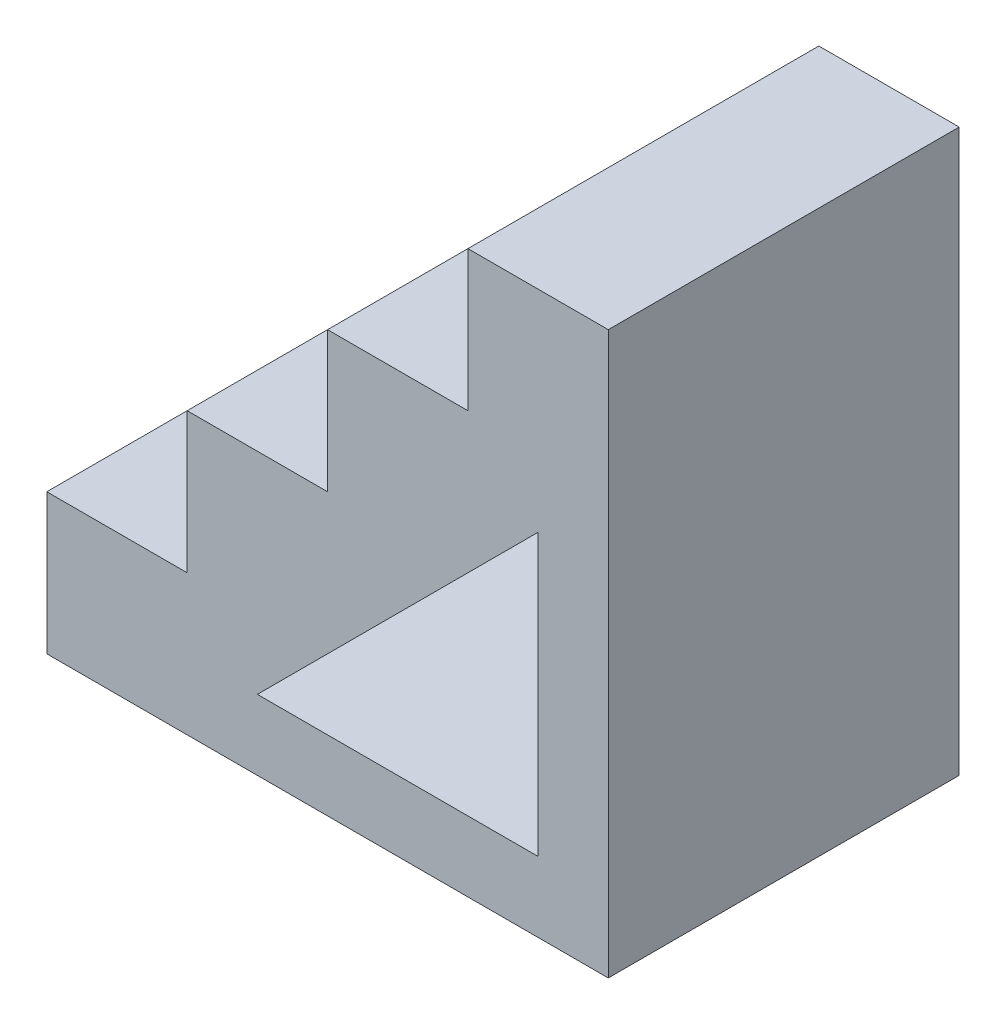
ISO-10303-21;
HEADER;
FILE_DESCRIPTION(('STEP AP214'),'2;1');
FILE_NAME('part.step','',(''),(''),'','','');
FILE_SCHEMA(('AUTOMOTIVE_DESIGN { 1 0 10303 214 1 1 1 1 }'));
ENDSEC;
DATA;
#1=APPLICATION_CONTEXT('core data for automotive mechanical design processes');
#2=APPLICATION_PROTOCOL_DEFINITION('international standard','automotive_design',2000,#1);
#3=PRODUCT_CONTEXT('',#1,'mechanical');
#4=PRODUCT('Part','Part','',(#3));
#5=PRODUCT_RELATED_PRODUCT_CATEGORY('part','',(#4));
#6=PRODUCT_DEFINITION_FORMATION('','',#4);
#7=PRODUCT_DEFINITION_CONTEXT('part definition',#1,'design');
#8=PRODUCT_DEFINITION('design','',#6,#7);
#9=PRODUCT_DEFINITION_SHAPE('','',#8);
#10=(LENGTH_UNIT() NAMED_UNIT(*) SI_UNIT(.MILLI.,.METRE.));
#11=(NAMED_UNIT(*) PLANE_ANGLE_UNIT() SI_UNIT($,.RADIAN.));
#12=(NAMED_UNIT(*) SI_UNIT($,.STERADIAN.) SOLID_ANGLE_UNIT());
#13=UNCERTAINTY_MEASURE_WITH_UNIT(LENGTH_MEASURE(1.E-05),#10,'distance_accuracy_value','');
#14=(GEOMETRIC_REPRESENTATION_CONTEXT(3) GLOBAL_UNCERTAINTY_ASSIGNED_CONTEXT((#13)) GLOBAL_UNIT_ASSIGNED_CONTEXT((#10,
#11,#12)) REPRESENTATION_CONTEXT('',''));
#15=CARTESIAN_POINT('',(0.,0.,0.));
#16=DIRECTION('',(0.,0.,1.));
#17=DIRECTION('',(1.,0.,0.));
#18=AXIS2_PLACEMENT_3D('',#15,#16,#17);
#19=CARTESIAN_POINT('',(20.,20.,50.));
#20=DIRECTION('',(-1.,0.,0.));
#21=DIRECTION('',(0.,-1.,0.));
#22=AXIS2_PLACEMENT_3D('',#19,#20,#21);
#23=PLANE('',#22);
#24=DIRECTION('',(0.,1.,0.));
#25=VECTOR('',#24,1.);
#26=CARTESIAN_POINT('',(20.,20.,0.));
#27=LINE('',#26,#25);
#28=CARTESIAN_POINT('',(20.,20.,0.));
#29=VERTEX_POINT('',#28);
#30=CARTESIAN_POINT('',(20.,40.,0.));
#31=VERTEX_POINT('',#30);
#32=EDGE_CURVE('E157',#29,#31,#27,.T.);
#33=ORIENTED_EDGE('',*,*,#32,.F.);
#34=DIRECTION('',(0.,0.,-1.));
#35=VECTOR('',#34,1.);
#36=CARTESIAN_POINT('',(20.,20.,50.));
#37=LINE('',#36,#35);
#38=CARTESIAN_POINT('',(20.,20.,50.));
#39=VERTEX_POINT('',#38);
#40=EDGE_CURVE('E11',#39,#29,#37,.T.);
#41=ORIENTED_EDGE('',*,*,#40,.F.);
#42=DIRECTION('',(0.,1.,0.));
#43=VECTOR('',#42,1.);
#44=CARTESIAN_POINT('',(20.,20.,50.));
#45=LINE('',#44,#43);
#46=CARTESIAN_POINT('',(20.,40.,50.));
#47=VERTEX_POINT('',#46);
#48=EDGE_CURVE('E159',#39,#47,#45,.T.);
#49=ORIENTED_EDGE('',*,*,#48,.T.);
#50=DIRECTION('',(0.,0.,-1.));
#51=VECTOR('',#50,1.);
#52=CARTESIAN_POINT('',(20.,40.,50.));
#53=LINE('',#52,#51);
#54=EDGE_CURVE('E39',#47,#31,#53,.T.);
#55=ORIENTED_EDGE('',*,*,#54,.T.);
#56=EDGE_LOOP('',(#33,#41,#49,#55));
#57=FACE_BOUND('',#56,.T.);
#58=ADVANCED_FACE('F36',(#57),#23,.T.);
#59=CARTESIAN_POINT('',(0.,20.,50.));
#60=DIRECTION('',(0.,1.,0.));
#61=DIRECTION('',(-1.,0.,0.));
#62=AXIS2_PLACEMENT_3D('',#59,#60,#61);
#63=PLANE('',#62);
#64=DIRECTION('',(1.,0.,0.));
#65=VECTOR('',#64,1.);
#66=CARTESIAN_POINT('',(0.,20.,0.));
#67=LINE('',#66,#65);
#68=CARTESIAN_POINT('',(0.,20.,0.));
#69=VERTEX_POINT('',#68);
#70=EDGE_CURVE('E163',#69,#29,#67,.T.);
#71=ORIENTED_EDGE('',*,*,#70,.F.);
#72=DIRECTION('',(0.,0.,-1.));
#73=VECTOR('',#72,1.);
#74=CARTESIAN_POINT('',(0.,20.,50.));
#75=LINE('',#74,#73);
#76=CARTESIAN_POINT('',(0.,20.,50.));
#77=VERTEX_POINT('',#76);
#78=EDGE_CURVE('E44',#77,#69,#75,.T.);
#79=ORIENTED_EDGE('',*,*,#78,.F.);
#80=DIRECTION('',(1.,0.,0.));
#81=VECTOR('',#80,1.);
#82=CARTESIAN_POINT('',(0.,20.,50.));
#83=LINE('',#82,#81);
#84=EDGE_CURVE('E187',#77,#39,#83,.T.);
#85=ORIENTED_EDGE('',*,*,#84,.T.);
#86=ORIENTED_EDGE('',*,*,#40,.T.);
#87=EDGE_LOOP('',(#71,#79,#85,#86));
#88=FACE_BOUND('',#87,.T.);
#89=ADVANCED_FACE('F242',(#88),#63,.T.);
#90=CARTESIAN_POINT('',(0.,0.,50.));
#91=DIRECTION('',(-1.,0.,0.));
#92=DIRECTION('',(0.,0.,1.));
#93=AXIS2_PLACEMENT_3D('',#90,#91,#92);
#94=PLANE('',#93);
#95=DIRECTION('',(0.,1.,0.));
#96=VECTOR('',#95,1.);
#97=CARTESIAN_POINT('',(0.,0.,0.));
#98=LINE('',#97,#96);
#99=CARTESIAN_POINT('',(0.,0.,0.));
#100=VERTEX_POINT('',#99);
#101=EDGE_CURVE('E213',#100,#69,#98,.T.);
#102=ORIENTED_EDGE('',*,*,#101,.F.);
#103=DIRECTION('',(0.,0.,-1.));
#104=VECTOR('',#103,1.);
#105=CARTESIAN_POINT('',(0.,0.,50.));
#106=LINE('',#105,#104);
#107=CARTESIAN_POINT('',(0.,0.,50.));
#108=VERTEX_POINT('',#107);
#109=EDGE_CURVE('E219',#108,#100,#106,.T.);
#110=ORIENTED_EDGE('',*,*,#109,.F.);
#111=DIRECTION('',(0.,1.,0.));
#112=VECTOR('',#111,1.);
#113=CARTESIAN_POINT('',(0.,0.,50.));
#114=LINE('',#113,#112);
#115=EDGE_CURVE('E184',#108,#77,#114,.T.);
#116=ORIENTED_EDGE('',*,*,#115,.T.);
#117=ORIENTED_EDGE('',*,*,#78,.T.);
#118=EDGE_LOOP('',(#102,#110,#116,#117));
#119=FACE_BOUND('',#118,.T.);
#120=ADVANCED_FACE('F271',(#119),#94,.T.);
#121=CARTESIAN_POINT('',(80.,0.,50.));
#122=DIRECTION('',(0.,-1.,0.));
#123=DIRECTION('',(1.,0.,0.));
#124=AXIS2_PLACEMENT_3D('',#121,#122,#123);
#125=PLANE('',#124);
#126=DIRECTION('',(-1.,0.,0.));
#127=VECTOR('',#126,1.);
#128=CARTESIAN_POINT('',(80.,0.,0.));
#129=LINE('',#128,#127);
#130=CARTESIAN_POINT('',(80.,0.,0.));
#131=VERTEX_POINT('',#130);
#132=EDGE_CURVE('E210',#131,#100,#129,.T.);
#133=ORIENTED_EDGE('',*,*,#132,.F.);
#134=DIRECTION('',(0.,0.,-1.));
#135=VECTOR('',#134,1.);
#136=CARTESIAN_POINT('',(80.,0.,50.));
#137=LINE('',#136,#135);
#138=CARTESIAN_POINT('',(80.,0.,50.));
#139=VERTEX_POINT('',#138);
#140=EDGE_CURVE('E221',#139,#131,#137,.T.);
#141=ORIENTED_EDGE('',*,*,#140,.F.);
#142=DIRECTION('',(-1.,0.,0.));
#143=VECTOR('',#142,1.);
#144=CARTESIAN_POINT('',(80.,0.,50.));
#145=LINE('',#144,#143);
#146=EDGE_CURVE('E181',#139,#108,#145,.T.);
#147=ORIENTED_EDGE('',*,*,#146,.T.);
#148=ORIENTED_EDGE('',*,*,#109,.T.);
#149=EDGE_LOOP('',(#133,#141,#147,#148));
#150=FACE_BOUND('',#149,.T.);
#151=ADVANCED_FACE('F269',(#150),#125,.T.);
#152=CARTESIAN_POINT('',(80.,80.,50.));
#153=DIRECTION('',(1.,0.,0.));
#154=DIRECTION('',(0.,1.,0.));
#155=AXIS2_PLACEMENT_3D('',#152,#153,#154);
#156=PLANE('',#155);
#157=DIRECTION('',(0.,-1.,0.));
#158=VECTOR('',#157,1.);
#159=CARTESIAN_POINT('',(80.,80.,0.));
#160=LINE('',#159,#158);
#161=CARTESIAN_POINT('',(80.,80.,0.));
#162=VERTEX_POINT('',#161);
#163=EDGE_CURVE('E207',#162,#131,#160,.T.);
#164=ORIENTED_EDGE('',*,*,#163,.F.);
#165=DIRECTION('',(0.,0.,-1.));
#166=VECTOR('',#165,1.);
#167=CARTESIAN_POINT('',(80.,80.,50.));
#168=LINE('',#167,#166);
#169=CARTESIAN_POINT('',(80.,80.,50.));
#170=VERTEX_POINT('',#169);
#171=EDGE_CURVE('E223',#170,#162,#168,.T.);
#172=ORIENTED_EDGE('',*,*,#171,.F.);
#173=DIRECTION('',(0.,-1.,0.));
#174=VECTOR('',#173,1.);
#175=CARTESIAN_POINT('',(80.,80.,50.));
#176=LINE('',#175,#174);
#177=EDGE_CURVE('E178',#170,#139,#176,.T.);
#178=ORIENTED_EDGE('',*,*,#177,.T.);
#179=ORIENTED_EDGE('',*,*,#140,.T.);
#180=EDGE_LOOP('',(#164,#172,#178,#179));
#181=FACE_BOUND('',#180,.T.);
#182=ADVANCED_FACE('F265',(#181),#156,.T.);
#183=CARTESIAN_POINT('',(60.,80.,50.));
#184=DIRECTION('',(0.,1.,0.));
#185=DIRECTION('',(0.,0.,1.));
#186=AXIS2_PLACEMENT_3D('',#183,#184,#185);
#187=PLANE('',#186);
#188=DIRECTION('',(1.,0.,0.));
#189=VECTOR('',#188,1.);
#190=CARTESIAN_POINT('',(60.,80.,0.));
#191=LINE('',#190,#189);
#192=CARTESIAN_POINT('',(60.,80.,0.));
#193=VERTEX_POINT('',#192);
#194=EDGE_CURVE('E204',#193,#162,#191,.T.);
#195=ORIENTED_EDGE('',*,*,#194,.F.);
#196=DIRECTION('',(0.,0.,-1.));
#197=VECTOR('',#196,1.);
#198=CARTESIAN_POINT('',(60.,80.,50.));
#199=LINE('',#198,#197);
#200=CARTESIAN_POINT('',(60.,80.,50.));
#201=VERTEX_POINT('',#200);
#202=EDGE_CURVE('E225',#201,#193,#199,.T.);
#203=ORIENTED_EDGE('',*,*,#202,.F.);
#204=DIRECTION('',(1.,0.,0.));
#205=VECTOR('',#204,1.);
#206=CARTESIAN_POINT('',(60.,80.,50.));
#207=LINE('',#206,#205);
#208=EDGE_CURVE('E175',#201,#170,#207,.T.);
#209=ORIENTED_EDGE('',*,*,#208,.T.);
#210=ORIENTED_EDGE('',*,*,#171,.T.);
#211=EDGE_LOOP('',(#195,#203,#209,#210));
#212=FACE_BOUND('',#211,.T.);
#213=ADVANCED_FACE('F261',(#212),#187,.T.);
#214=CARTESIAN_POINT('',(60.,60.,50.));
#215=DIRECTION('',(-1.,0.,0.));
#216=DIRECTION('',(0.,0.,1.));
#217=AXIS2_PLACEMENT_3D('',#214,#215,#216);
#218=PLANE('',#217);
#219=DIRECTION('',(0.,1.,0.));
#220=VECTOR('',#219,1.);
#221=CARTESIAN_POINT('',(60.,60.,0.));
#222=LINE('',#221,#220);
#223=CARTESIAN_POINT('',(60.,60.,0.));
#224=VERTEX_POINT('',#223);
#225=EDGE_CURVE('E201',#224,#193,#222,.T.);
#226=ORIENTED_EDGE('',*,*,#225,.F.);
#227=DIRECTION('',(0.,0.,-1.));
#228=VECTOR('',#227,1.);
#229=CARTESIAN_POINT('',(60.,60.,50.));
#230=LINE('',#229,#228);
#231=CARTESIAN_POINT('',(60.,60.,50.));
#232=VERTEX_POINT('',#231);
#233=EDGE_CURVE('E227',#232,#224,#230,.T.);
#234=ORIENTED_EDGE('',*,*,#233,.F.);
#235=DIRECTION('',(0.,1.,0.));
#236=VECTOR('',#235,1.);
#237=CARTESIAN_POINT('',(60.,60.,50.));
#238=LINE('',#237,#236);
#239=EDGE_CURVE('E172',#232,#201,#238,.T.);
#240=ORIENTED_EDGE('',*,*,#239,.T.);
#241=ORIENTED_EDGE('',*,*,#202,.T.);
#242=EDGE_LOOP('',(#226,#234,#240,#241));
#243=FACE_BOUND('',#242,.T.);
#244=ADVANCED_FACE('F257',(#243),#218,.T.);
#245=CARTESIAN_POINT('',(40.,60.,50.));
#246=DIRECTION('',(0.,1.,0.));
#247=DIRECTION('',(-1.,0.,0.));
#248=AXIS2_PLACEMENT_3D('',#245,#246,#247);
#249=PLANE('',#248);
#250=DIRECTION('',(1.,0.,0.));
#251=VECTOR('',#250,1.);
#252=CARTESIAN_POINT('',(40.,60.,0.));
#253=LINE('',#252,#251);
#254=CARTESIAN_POINT('',(40.,60.,0.));
#255=VERTEX_POINT('',#254);
#256=EDGE_CURVE('E198',#255,#224,#253,.T.);
#257=ORIENTED_EDGE('',*,*,#256,.F.);
#258=DIRECTION('',(0.,0.,-1.));
#259=VECTOR('',#258,1.);
#260=CARTESIAN_POINT('',(40.,60.,50.));
#261=LINE('',#260,#259);
#262=CARTESIAN_POINT('',(40.,60.,50.));
#263=VERTEX_POINT('',#262);
#264=EDGE_CURVE('E229',#263,#255,#261,.T.);
#265=ORIENTED_EDGE('',*,*,#264,.F.);
#266=DIRECTION('',(1.,0.,0.));
#267=VECTOR('',#266,1.);
#268=CARTESIAN_POINT('',(40.,60.,50.));
#269=LINE('',#268,#267);
#270=EDGE_CURVE('E169',#263,#232,#269,.T.);
#271=ORIENTED_EDGE('',*,*,#270,.T.);
#272=ORIENTED_EDGE('',*,*,#233,.T.);
#273=EDGE_LOOP('',(#257,#265,#271,#272));
#274=FACE_BOUND('',#273,.T.);
#275=ADVANCED_FACE('F255',(#274),#249,.T.);
#276=CARTESIAN_POINT('',(40.,40.,50.));
#277=DIRECTION('',(-1.,0.,0.));
#278=DIRECTION('',(0.,-1.,0.));
#279=AXIS2_PLACEMENT_3D('',#276,#277,#278);
#280=PLANE('',#279);
#281=DIRECTION('',(0.,1.,0.));
#282=VECTOR('',#281,1.);
#283=CARTESIAN_POINT('',(40.,40.,0.));
#284=LINE('',#283,#282);
#285=CARTESIAN_POINT('',(40.,40.,0.));
#286=VERTEX_POINT('',#285);
#287=EDGE_CURVE('E195',#286,#255,#284,.T.);
#288=ORIENTED_EDGE('',*,*,#287,.F.);
#289=DIRECTION('',(0.,0.,-1.));
#290=VECTOR('',#289,1.);
#291=CARTESIAN_POINT('',(40.,40.,50.));
#292=LINE('',#291,#290);
#293=CARTESIAN_POINT('',(40.,40.,50.));
#294=VERTEX_POINT('',#293);
#295=EDGE_CURVE('E230',#294,#286,#292,.T.);
#296=ORIENTED_EDGE('',*,*,#295,.F.);
#297=DIRECTION('',(0.,1.,0.));
#298=VECTOR('',#297,1.);
#299=CARTESIAN_POINT('',(40.,40.,50.));
#300=LINE('',#299,#298);
#301=EDGE_CURVE('E166',#294,#263,#300,.T.);
#302=ORIENTED_EDGE('',*,*,#301,.T.);
#303=ORIENTED_EDGE('',*,*,#264,.T.);
#304=EDGE_LOOP('',(#288,#296,#302,#303));
#305=FACE_BOUND('',#304,.T.);
#306=ADVANCED_FACE('F251',(#305),#280,.T.);
#307=CARTESIAN_POINT('',(20.,40.,50.));
#308=DIRECTION('',(0.,1.,0.));
#309=DIRECTION('',(-1.,0.,0.));
#310=AXIS2_PLACEMENT_3D('',#307,#308,#309);
#311=PLANE('',#310);
#312=DIRECTION('',(1.,0.,0.));
#313=VECTOR('',#312,1.);
#314=CARTESIAN_POINT('',(20.,40.,0.));
#315=LINE('',#314,#313);
#316=EDGE_CURVE('E192',#31,#286,#315,.T.);
#317=ORIENTED_EDGE('',*,*,#316,.F.);
#318=ORIENTED_EDGE('',*,*,#54,.F.);
#319=DIRECTION('',(1.,0.,0.));
#320=VECTOR('',#319,1.);
#321=CARTESIAN_POINT('',(20.,40.,50.));
#322=LINE('',#321,#320);
#323=EDGE_CURVE('E162',#47,#294,#322,.T.);
#324=ORIENTED_EDGE('',*,*,#323,.T.);
#325=ORIENTED_EDGE('',*,*,#295,.T.);
#326=EDGE_LOOP('',(#317,#318,#324,#325));
#327=FACE_BOUND('',#326,.T.);
#328=ADVANCED_FACE('F238',(#327),#311,.T.);
#329=CARTESIAN_POINT('',(0.,0.,50.));
#330=DIRECTION('',(0.,0.,-1.));
#331=DIRECTION('',(-1.,0.,0.));
#332=AXIS2_PLACEMENT_3D('',#329,#330,#331);
#333=PLANE('',#332);
#334=DIRECTION('',(1.,0.,0.));
#335=VECTOR('',#334,1.);
#336=CARTESIAN_POINT('',(70.,10.,50.));
#337=LINE('',#336,#335);
#338=CARTESIAN_POINT('',(29.9999999999996,10.,50.));
#339=VERTEX_POINT('',#338);
#340=CARTESIAN_POINT('',(70.,10.,50.));
#341=VERTEX_POINT('',#340);
#342=EDGE_CURVE('E149',#339,#341,#337,.T.);
#343=ORIENTED_EDGE('',*,*,#342,.F.);
#344=DIRECTION('',(-0.707106781186551,-0.707106781186544,0.));
#345=VECTOR('',#344,1.);
#346=CARTESIAN_POINT('',(29.9999999999996,10.,50.));
#347=LINE('',#346,#345);
#348=CARTESIAN_POINT('',(70.,50.,50.));
#349=VERTEX_POINT('',#348);
#350=EDGE_CURVE('E52',#349,#339,#347,.T.);
#351=ORIENTED_EDGE('',*,*,#350,.F.);
#352=DIRECTION('',(0.,1.,0.));
#353=VECTOR('',#352,1.);
#354=CARTESIAN_POINT('',(70.,50.,50.));
#355=LINE('',#354,#353);
#356=EDGE_CURVE('E146',#341,#349,#355,.T.);
#357=ORIENTED_EDGE('',*,*,#356,.F.);
#358=EDGE_LOOP('',(#343,#351,#357));
#359=FACE_BOUND('',#358,.T.);
#360=ORIENTED_EDGE('',*,*,#48,.F.);
#361=ORIENTED_EDGE('',*,*,#84,.F.);
#362=ORIENTED_EDGE('',*,*,#115,.F.);
#363=ORIENTED_EDGE('',*,*,#146,.F.);
#364=ORIENTED_EDGE('',*,*,#177,.F.);
#365=ORIENTED_EDGE('',*,*,#208,.F.);
#366=ORIENTED_EDGE('',*,*,#239,.F.);
#367=ORIENTED_EDGE('',*,*,#270,.F.);
#368=ORIENTED_EDGE('',*,*,#301,.F.);
#369=ORIENTED_EDGE('',*,*,#323,.F.);
#370=EDGE_LOOP('',(#360,#361,#362,#363,#364,#365,#366,#367,#368,#369));
#371=FACE_BOUND('',#370,.T.);
#372=ADVANCED_FACE('F245',(#359,#371),#333,.F.);
#373=CARTESIAN_POINT('',(0.,0.,0.));
#374=DIRECTION('',(0.,0.,-1.));
#375=DIRECTION('',(-1.,0.,0.));
#376=AXIS2_PLACEMENT_3D('',#373,#374,#375);
#377=PLANE('',#376);
#378=DIRECTION('',(-0.707106781186551,-0.707106781186544,0.));
#379=VECTOR('',#378,1.);
#380=CARTESIAN_POINT('',(29.9999999999996,10.,0.));
#381=LINE('',#380,#379);
#382=CARTESIAN_POINT('',(70.,50.,0.));
#383=VERTEX_POINT('',#382);
#384=CARTESIAN_POINT('',(29.9999999999996,10.,0.));
#385=VERTEX_POINT('',#384);
#386=EDGE_CURVE('E133',#383,#385,#381,.T.);
#387=ORIENTED_EDGE('',*,*,#386,.T.);
#388=DIRECTION('',(1.,0.,0.));
#389=VECTOR('',#388,1.);
#390=CARTESIAN_POINT('',(70.,10.,0.));
#391=LINE('',#390,#389);
#392=CARTESIAN_POINT('',(70.,10.,0.));
#393=VERTEX_POINT('',#392);
#394=EDGE_CURVE('E140',#385,#393,#391,.T.);
#395=ORIENTED_EDGE('',*,*,#394,.T.);
#396=DIRECTION('',(0.,1.,0.));
#397=VECTOR('',#396,1.);
#398=CARTESIAN_POINT('',(70.,50.,0.));
#399=LINE('',#398,#397);
#400=EDGE_CURVE('E60',#393,#383,#399,.T.);
#401=ORIENTED_EDGE('',*,*,#400,.T.);
#402=EDGE_LOOP('',(#387,#395,#401));
#403=FACE_BOUND('',#402,.T.);
#404=ORIENTED_EDGE('',*,*,#32,.T.);
#405=ORIENTED_EDGE('',*,*,#316,.T.);
#406=ORIENTED_EDGE('',*,*,#287,.T.);
#407=ORIENTED_EDGE('',*,*,#256,.T.);
#408=ORIENTED_EDGE('',*,*,#225,.T.);
#409=ORIENTED_EDGE('',*,*,#194,.T.);
#410=ORIENTED_EDGE('',*,*,#163,.T.);
#411=ORIENTED_EDGE('',*,*,#132,.T.);
#412=ORIENTED_EDGE('',*,*,#101,.T.);
#413=ORIENTED_EDGE('',*,*,#70,.T.);
#414=EDGE_LOOP('',(#404,#405,#406,#407,#408,#409,#410,#411,#412,#413));
#415=FACE_BOUND('',#414,.T.);
#416=ADVANCED_FACE('F144',(#403,#415),#377,.T.);
#417=CARTESIAN_POINT('',(29.9999999999996,10.,0.));
#418=DIRECTION('',(-0.707106781186544,0.707106781186551,0.));
#419=DIRECTION('',(-0.707106781186551,-0.707106781186544,0.));
#420=AXIS2_PLACEMENT_3D('',#417,#418,#419);
#421=PLANE('',#420);
#422=ORIENTED_EDGE('',*,*,#350,.T.);
#423=DIRECTION('',(0.,0.,1.));
#424=VECTOR('',#423,1.);
#425=CARTESIAN_POINT('',(29.9999999999996,10.,0.));
#426=LINE('',#425,#424);
#427=EDGE_CURVE('E129',#385,#339,#426,.T.);
#428=ORIENTED_EDGE('',*,*,#427,.F.);
#429=ORIENTED_EDGE('',*,*,#386,.F.);
#430=DIRECTION('',(0.,0.,1.));
#431=VECTOR('',#430,1.);
#432=CARTESIAN_POINT('',(70.,50.,0.));
#433=LINE('',#432,#431);
#434=EDGE_CURVE('E155',#383,#349,#433,.T.);
#435=ORIENTED_EDGE('',*,*,#434,.T.);
#436=EDGE_LOOP('',(#422,#428,#429,#435));
#437=FACE_BOUND('',#436,.T.);
#438=ADVANCED_FACE('F131',(#437),#421,.F.);
#439=CARTESIAN_POINT('',(70.,50.,0.));
#440=DIRECTION('',(1.,0.,0.));
#441=DIRECTION('',(0.,0.,-1.));
#442=AXIS2_PLACEMENT_3D('',#439,#440,#441);
#443=PLANE('',#442);
#444=ORIENTED_EDGE('',*,*,#356,.T.);
#445=ORIENTED_EDGE('',*,*,#434,.F.);
#446=ORIENTED_EDGE('',*,*,#400,.F.);
#447=DIRECTION('',(0.,0.,1.));
#448=VECTOR('',#447,1.);
#449=CARTESIAN_POINT('',(70.,10.,0.));
#450=LINE('',#449,#448);
#451=EDGE_CURVE('E137',#393,#341,#450,.T.);
#452=ORIENTED_EDGE('',*,*,#451,.T.);
#453=EDGE_LOOP('',(#444,#445,#446,#452));
#454=FACE_BOUND('',#453,.T.);
#455=ADVANCED_FACE('F336',(#454),#443,.F.);
#456=CARTESIAN_POINT('',(70.,10.,0.));
#457=DIRECTION('',(0.,-1.,0.));
#458=DIRECTION('',(1.,0.,0.));
#459=AXIS2_PLACEMENT_3D('',#456,#457,#458);
#460=PLANE('',#459);
#461=ORIENTED_EDGE('',*,*,#342,.T.);
#462=ORIENTED_EDGE('',*,*,#451,.F.);
#463=ORIENTED_EDGE('',*,*,#394,.F.);
#464=ORIENTED_EDGE('',*,*,#427,.T.);
#465=EDGE_LOOP('',(#461,#462,#463,#464));
#466=FACE_BOUND('',#465,.T.);
#467=ADVANCED_FACE('F141',(#466),#460,.F.);
#468=CLOSED_SHELL('',(#58,#89,#120,#151,#182,#213,#244,#275,#306,#328,#372,#416,#438,#455,#467));
#469=MANIFOLD_SOLID_BREP('B2',#468);
#470=ADVANCED_BREP_SHAPE_REPRESENTATION('',(#18,#469),#14);
#471=SHAPE_DEFINITION_REPRESENTATION(#9,#470);
ENDSEC;
END-ISO-10303-21;
